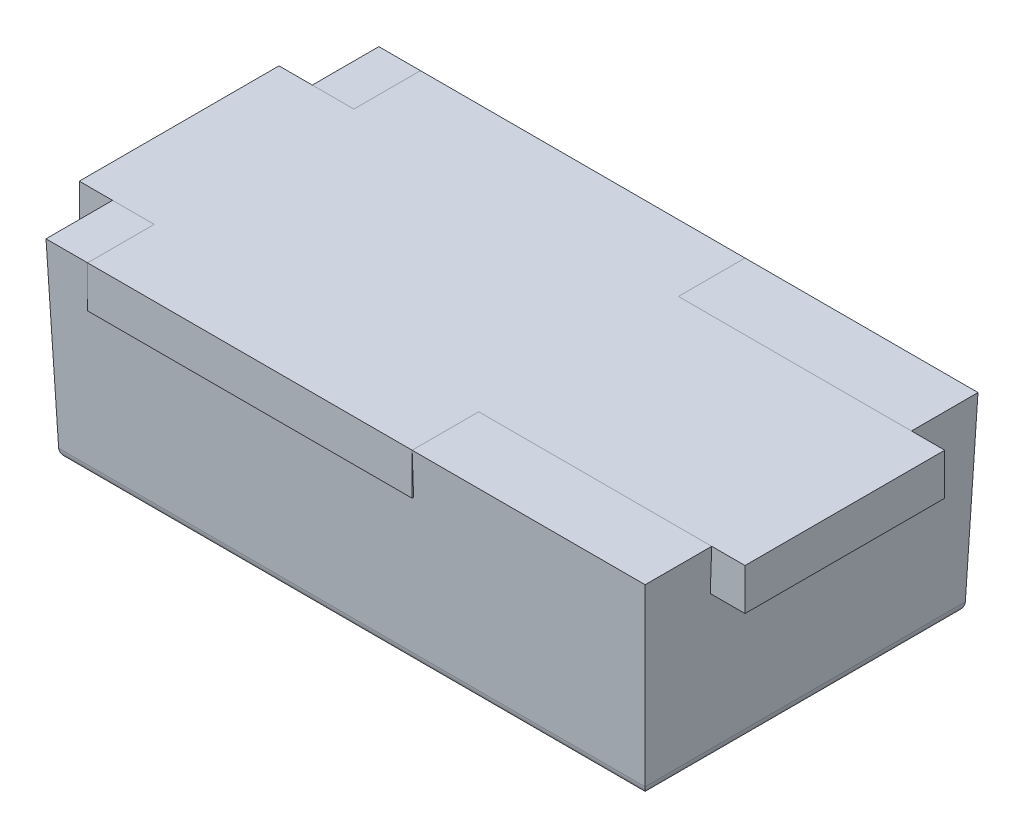
ISO-10303-21;
HEADER;
FILE_DESCRIPTION(('STEP AP214'),'2;1');
FILE_NAME('part.step','',(''),(''),'','','');
FILE_SCHEMA(('AUTOMOTIVE_DESIGN { 1 0 10303 214 1 1 1 1 }'));
ENDSEC;
DATA;
#1=APPLICATION_CONTEXT('core data for automotive mechanical design processes');
#2=APPLICATION_PROTOCOL_DEFINITION('international standard','automotive_design',2000,#1);
#3=PRODUCT_CONTEXT('',#1,'mechanical');
#4=PRODUCT('Part','Part','',(#3));
#5=PRODUCT_RELATED_PRODUCT_CATEGORY('part','',(#4));
#6=PRODUCT_DEFINITION_FORMATION('','',#4);
#7=PRODUCT_DEFINITION_CONTEXT('part definition',#1,'design');
#8=PRODUCT_DEFINITION('design','',#6,#7);
#9=PRODUCT_DEFINITION_SHAPE('','',#8);
#10=(LENGTH_UNIT() NAMED_UNIT(*) SI_UNIT(.MILLI.,.METRE.));
#11=(NAMED_UNIT(*) PLANE_ANGLE_UNIT() SI_UNIT($,.RADIAN.));
#12=(NAMED_UNIT(*) SI_UNIT($,.STERADIAN.) SOLID_ANGLE_UNIT());
#13=UNCERTAINTY_MEASURE_WITH_UNIT(LENGTH_MEASURE(1.E-05),#10,'distance_accuracy_value','');
#14=(GEOMETRIC_REPRESENTATION_CONTEXT(3) GLOBAL_UNCERTAINTY_ASSIGNED_CONTEXT((#13)) GLOBAL_UNIT_ASSIGNED_CONTEXT((#10,
#11,#12)) REPRESENTATION_CONTEXT('',''));
#15=CARTESIAN_POINT('',(0.,0.,0.));
#16=DIRECTION('',(0.,0.,1.));
#17=DIRECTION('',(1.,0.,0.));
#18=AXIS2_PLACEMENT_3D('',#15,#16,#17);
#19=CARTESIAN_POINT('',(-2.,-0.25,0.6));
#20=DIRECTION('',(0.,0.,1.));
#21=DIRECTION('',(1.,0.,0.));
#22=AXIS2_PLACEMENT_3D('',#19,#20,#21);
#23=PLANE('',#22);
#24=DIRECTION('',(0.,1.,0.));
#25=VECTOR('',#24,1.);
#26=CARTESIAN_POINT('',(0.4,-0.25,0.6));
#27=LINE('',#26,#25);
#28=CARTESIAN_POINT('',(0.399999999999999,0.,0.6));
#29=VERTEX_POINT('',#28);
#30=CARTESIAN_POINT('',(0.4,-0.25,0.6));
#31=VERTEX_POINT('',#30);
#32=EDGE_CURVE('P0_E109',#29,#31,#27,.F.);
#33=ORIENTED_EDGE('',*,*,#32,.F.);
#34=DIRECTION('',(1.,0.,0.));
#35=VECTOR('',#34,1.);
#36=CARTESIAN_POINT('',(0.,0.,0.6));
#37=LINE('',#36,#35);
#38=CARTESIAN_POINT('',(1.8,0.,0.6));
#39=VERTEX_POINT('',#38);
#40=EDGE_CURVE('P0_E150',#39,#29,#37,.F.);
#41=ORIENTED_EDGE('',*,*,#40,.F.);
#42=DIRECTION('',(0.0348994967025021,0.999390827019096,0.));
#43=VECTOR('',#42,1.);
#44=CARTESIAN_POINT('',(1.79126980762706,-0.25,0.6));
#45=LINE('',#44,#43);
#46=CARTESIAN_POINT('',(1.79126980762706,-0.25,0.6));
#47=VERTEX_POINT('',#46);
#48=EDGE_CURVE('P0_E101',#47,#39,#45,.T.);
#49=ORIENTED_EDGE('',*,*,#48,.F.);
#50=DIRECTION('',(1.,0.,0.));
#51=VECTOR('',#50,1.);
#52=CARTESIAN_POINT('',(0.,-0.25,0.6));
#53=LINE('',#52,#51);
#54=EDGE_CURVE('P0_E214',#31,#47,#53,.T.);
#55=ORIENTED_EDGE('',*,*,#54,.F.);
#56=EDGE_LOOP('',(#33,#41,#49,#55));
#57=FACE_BOUND('',#56,.T.);
#58=ADVANCED_FACE('P0_F16',(#57),#23,.F.);
#59=CARTESIAN_POINT('',(-2.,-0.25,-0.6));
#60=DIRECTION('',(0.,0.,1.));
#61=DIRECTION('',(1.,0.,0.));
#62=AXIS2_PLACEMENT_3D('',#59,#60,#61);
#63=PLANE('',#62);
#64=DIRECTION('',(0.,1.,0.));
#65=VECTOR('',#64,1.);
#66=CARTESIAN_POINT('',(0.399999999999999,-0.25,-0.6));
#67=LINE('',#66,#65);
#68=CARTESIAN_POINT('',(0.399999999999999,-0.25,-0.6));
#69=VERTEX_POINT('',#68);
#70=CARTESIAN_POINT('',(0.399999999999999,0.,-0.6));
#71=VERTEX_POINT('',#70);
#72=EDGE_CURVE('P0_E198',#69,#71,#67,.T.);
#73=ORIENTED_EDGE('',*,*,#72,.F.);
#74=DIRECTION('',(1.,0.,0.));
#75=VECTOR('',#74,1.);
#76=CARTESIAN_POINT('',(0.,-0.25,-0.6));
#77=LINE('',#76,#75);
#78=CARTESIAN_POINT('',(1.79126980762706,-0.25,-0.6));
#79=VERTEX_POINT('',#78);
#80=EDGE_CURVE('P0_E204',#79,#69,#77,.F.);
#81=ORIENTED_EDGE('',*,*,#80,.F.);
#82=DIRECTION('',(0.0348994967025021,0.999390827019096,0.));
#83=VECTOR('',#82,1.);
#84=CARTESIAN_POINT('',(1.79126980762706,-0.25,-0.6));
#85=LINE('',#84,#83);
#86=CARTESIAN_POINT('',(1.8,0.,-0.6));
#87=VERTEX_POINT('',#86);
#88=EDGE_CURVE('P0_E201',#79,#87,#85,.T.);
#89=ORIENTED_EDGE('',*,*,#88,.T.);
#90=DIRECTION('',(1.,0.,0.));
#91=VECTOR('',#90,1.);
#92=CARTESIAN_POINT('',(0.,0.,-0.6));
#93=LINE('',#92,#91);
#94=EDGE_CURVE('P0_E248',#71,#87,#93,.T.);
#95=ORIENTED_EDGE('',*,*,#94,.F.);
#96=EDGE_LOOP('',(#73,#81,#89,#95));
#97=FACE_BOUND('',#96,.T.);
#98=ADVANCED_FACE('P0_F566',(#97),#63,.T.);
#99=CARTESIAN_POINT('',(-1.55,-0.25,0.));
#100=DIRECTION('',(-1.,0.,0.));
#101=DIRECTION('',(0.,0.,1.));
#102=AXIS2_PLACEMENT_3D('',#99,#100,#101);
#103=PLANE('',#102);
#104=DIRECTION('',(0.,1.,0.));
#105=VECTOR('',#104,1.);
#106=CARTESIAN_POINT('',(-1.55,-0.25,-0.6));
#107=LINE('',#106,#105);
#108=CARTESIAN_POINT('',(-1.55,-0.25,-0.6));
#109=VERTEX_POINT('',#108);
#110=CARTESIAN_POINT('',(-1.55,0.,-0.6));
#111=VERTEX_POINT('',#110);
#112=EDGE_CURVE('P0_E131',#109,#111,#107,.T.);
#113=ORIENTED_EDGE('',*,*,#112,.F.);
#114=DIRECTION('',(0.,0.,1.));
#115=VECTOR('',#114,1.);
#116=CARTESIAN_POINT('',(-1.55,-0.25,0.));
#117=LINE('',#116,#115);
#118=CARTESIAN_POINT('',(-1.55,-0.25,-0.991269807627063));
#119=VERTEX_POINT('',#118);
#120=EDGE_CURVE('P0_E195',#119,#109,#117,.T.);
#121=ORIENTED_EDGE('',*,*,#120,.F.);
#122=DIRECTION('',(0.,0.999390827019096,-0.034899496702501));
#123=VECTOR('',#122,1.);
#124=CARTESIAN_POINT('',(-1.55,0.,-1.));
#125=LINE('',#124,#123);
#126=CARTESIAN_POINT('',(-1.55,0.,-1.));
#127=VERTEX_POINT('',#126);
#128=EDGE_CURVE('P0_E155',#127,#119,#125,.F.);
#129=ORIENTED_EDGE('',*,*,#128,.F.);
#130=DIRECTION('',(0.,0.,1.));
#131=VECTOR('',#130,1.);
#132=CARTESIAN_POINT('',(-1.55,0.,0.));
#133=LINE('',#132,#131);
#134=EDGE_CURVE('P0_E143',#111,#127,#133,.F.);
#135=ORIENTED_EDGE('',*,*,#134,.F.);
#136=EDGE_LOOP('',(#113,#121,#129,#135));
#137=FACE_BOUND('',#136,.T.);
#138=ADVANCED_FACE('P0_F153',(#137),#103,.F.);
#139=CARTESIAN_POINT('',(0.399999999999999,-0.25,0.));
#140=DIRECTION('',(-1.,0.,0.));
#141=DIRECTION('',(0.,0.,1.));
#142=AXIS2_PLACEMENT_3D('',#139,#140,#141);
#143=PLANE('',#142);
#144=ORIENTED_EDGE('',*,*,#72,.T.);
#145=DIRECTION('',(0.,0.,1.));
#146=VECTOR('',#145,1.);
#147=CARTESIAN_POINT('',(0.399999999999999,0.,0.));
#148=LINE('',#147,#146);
#149=CARTESIAN_POINT('',(0.399999999999999,0.,-1.));
#150=VERTEX_POINT('',#149);
#151=EDGE_CURVE('P0_E200',#150,#71,#148,.T.);
#152=ORIENTED_EDGE('',*,*,#151,.F.);
#153=DIRECTION('',(0.,0.999390827019096,-0.034899496702501));
#154=VECTOR('',#153,1.);
#155=CARTESIAN_POINT('',(0.399999999999999,0.,-1.));
#156=LINE('',#155,#154);
#157=CARTESIAN_POINT('',(0.399999999999999,-0.25,-0.991269807627063));
#158=VERTEX_POINT('',#157);
#159=EDGE_CURVE('P0_E299',#158,#150,#156,.T.);
#160=ORIENTED_EDGE('',*,*,#159,.F.);
#161=DIRECTION('',(0.,0.,1.));
#162=VECTOR('',#161,1.);
#163=CARTESIAN_POINT('',(0.399999999999999,-0.25,0.));
#164=LINE('',#163,#162);
#165=EDGE_CURVE('P0_E206',#69,#158,#164,.F.);
#166=ORIENTED_EDGE('',*,*,#165,.F.);
#167=EDGE_LOOP('',(#144,#152,#160,#166));
#168=FACE_BOUND('',#167,.T.);
#169=ADVANCED_FACE('P0_F373',(#168),#143,.T.);
#170=CARTESIAN_POINT('',(0.,0.,0.));
#171=DIRECTION('',(0.,1.,0.));
#172=DIRECTION('',(0.,0.,1.));
#173=AXIS2_PLACEMENT_3D('',#170,#171,#172);
#174=PLANE('',#173);
#175=ORIENTED_EDGE('',*,*,#94,.T.);
#176=DIRECTION('',(0.,0.,1.));
#177=VECTOR('',#176,1.);
#178=CARTESIAN_POINT('',(1.8,0.,0.));
#179=LINE('',#178,#177);
#180=CARTESIAN_POINT('',(1.8,0.,-1.));
#181=VERTEX_POINT('',#180);
#182=EDGE_CURVE('P0_E65',#87,#181,#179,.F.);
#183=ORIENTED_EDGE('',*,*,#182,.T.);
#184=DIRECTION('',(1.,0.,0.));
#185=VECTOR('',#184,1.);
#186=CARTESIAN_POINT('',(-1.8,0.,-1.));
#187=LINE('',#186,#185);
#188=EDGE_CURVE('P0_E295',#150,#181,#187,.T.);
#189=ORIENTED_EDGE('',*,*,#188,.F.);
#190=ORIENTED_EDGE('',*,*,#151,.T.);
#191=EDGE_LOOP('',(#175,#183,#189,#190));
#192=FACE_BOUND('',#191,.T.);
#193=ADVANCED_FACE('P0_F543',(#192),#174,.T.);
#194=CARTESIAN_POINT('',(-2.,-0.25,0.6));
#195=DIRECTION('',(0.,0.,1.));
#196=DIRECTION('',(1.,0.,0.));
#197=AXIS2_PLACEMENT_3D('',#194,#195,#196);
#198=PLANE('',#197);
#199=DIRECTION('',(1.,0.,0.));
#200=VECTOR('',#199,1.);
#201=CARTESIAN_POINT('',(0.,0.,0.6));
#202=LINE('',#201,#200);
#203=CARTESIAN_POINT('',(-1.55,0.,0.6));
#204=VERTEX_POINT('',#203);
#205=CARTESIAN_POINT('',(-1.8,0.,0.6));
#206=VERTEX_POINT('',#205);
#207=EDGE_CURVE('P0_E166',#204,#206,#202,.F.);
#208=ORIENTED_EDGE('',*,*,#207,.F.);
#209=DIRECTION('',(0.,1.,0.));
#210=VECTOR('',#209,1.);
#211=CARTESIAN_POINT('',(-1.55,-0.25,0.6));
#212=LINE('',#211,#210);
#213=CARTESIAN_POINT('',(-1.55,-0.25,0.6));
#214=VERTEX_POINT('',#213);
#215=EDGE_CURVE('P0_E170',#204,#214,#212,.F.);
#216=ORIENTED_EDGE('',*,*,#215,.T.);
#217=DIRECTION('',(1.,0.,0.));
#218=VECTOR('',#217,1.);
#219=CARTESIAN_POINT('',(0.,-0.25,0.6));
#220=LINE('',#219,#218);
#221=CARTESIAN_POINT('',(-1.79126980762706,-0.25,0.6));
#222=VERTEX_POINT('',#221);
#223=EDGE_CURVE('P0_E186',#222,#214,#220,.T.);
#224=ORIENTED_EDGE('',*,*,#223,.F.);
#225=DIRECTION('',(0.034899496702501,-0.999390827019096,0.));
#226=VECTOR('',#225,1.);
#227=CARTESIAN_POINT('',(-1.8,0.,0.6));
#228=LINE('',#227,#226);
#229=EDGE_CURVE('P0_E239',#206,#222,#228,.T.);
#230=ORIENTED_EDGE('',*,*,#229,.F.);
#231=EDGE_LOOP('',(#208,#216,#224,#230));
#232=FACE_BOUND('',#231,.T.);
#233=ADVANCED_FACE('P0_F535',(#232),#198,.F.);
#234=CARTESIAN_POINT('',(-2.,-0.25,-0.6));
#235=DIRECTION('',(0.,0.,1.));
#236=DIRECTION('',(1.,0.,0.));
#237=AXIS2_PLACEMENT_3D('',#234,#235,#236);
#238=PLANE('',#237);
#239=DIRECTION('',(1.,0.,0.));
#240=VECTOR('',#239,1.);
#241=CARTESIAN_POINT('',(0.,0.,-0.6));
#242=LINE('',#241,#240);
#243=CARTESIAN_POINT('',(-1.8,0.,-0.6));
#244=VERTEX_POINT('',#243);
#245=EDGE_CURVE('P0_E136',#244,#111,#242,.T.);
#246=ORIENTED_EDGE('',*,*,#245,.F.);
#247=DIRECTION('',(0.034899496702501,-0.999390827019096,0.));
#248=VECTOR('',#247,1.);
#249=CARTESIAN_POINT('',(-1.8,0.,-0.6));
#250=LINE('',#249,#248);
#251=CARTESIAN_POINT('',(-1.79126980762706,-0.25,-0.6));
#252=VERTEX_POINT('',#251);
#253=EDGE_CURVE('P0_E238',#252,#244,#250,.F.);
#254=ORIENTED_EDGE('',*,*,#253,.F.);
#255=DIRECTION('',(1.,0.,0.));
#256=VECTOR('',#255,1.);
#257=CARTESIAN_POINT('',(0.,-0.25,-0.6));
#258=LINE('',#257,#256);
#259=EDGE_CURVE('P0_E139',#109,#252,#258,.F.);
#260=ORIENTED_EDGE('',*,*,#259,.F.);
#261=ORIENTED_EDGE('',*,*,#112,.T.);
#262=EDGE_LOOP('',(#246,#254,#260,#261));
#263=FACE_BOUND('',#262,.T.);
#264=ADVANCED_FACE('P0_F133',(#263),#238,.T.);
#265=CARTESIAN_POINT('',(0.,0.,0.));
#266=DIRECTION('',(0.,1.,0.));
#267=DIRECTION('',(0.,0.,1.));
#268=AXIS2_PLACEMENT_3D('',#265,#266,#267);
#269=PLANE('',#268);
#270=DIRECTION('',(0.,0.,1.));
#271=VECTOR('',#270,1.);
#272=CARTESIAN_POINT('',(-1.8,0.,-1.));
#273=LINE('',#272,#271);
#274=CARTESIAN_POINT('',(-1.8,0.,-1.));
#275=VERTEX_POINT('',#274);
#276=EDGE_CURVE('P0_E149',#244,#275,#273,.F.);
#277=ORIENTED_EDGE('',*,*,#276,.F.);
#278=ORIENTED_EDGE('',*,*,#245,.T.);
#279=ORIENTED_EDGE('',*,*,#134,.T.);
#280=DIRECTION('',(1.,0.,0.));
#281=VECTOR('',#280,1.);
#282=CARTESIAN_POINT('',(-1.8,0.,-1.));
#283=LINE('',#282,#281);
#284=EDGE_CURVE('P0_E326',#275,#127,#283,.T.);
#285=ORIENTED_EDGE('',*,*,#284,.F.);
#286=EDGE_LOOP('',(#277,#278,#279,#285));
#287=FACE_BOUND('',#286,.T.);
#288=ADVANCED_FACE('P0_F146',(#287),#269,.T.);
#289=CARTESIAN_POINT('',(0.,0.,0.));
#290=DIRECTION('',(0.,1.,0.));
#291=DIRECTION('',(0.,0.,1.));
#292=AXIS2_PLACEMENT_3D('',#289,#290,#291);
#293=PLANE('',#292);
#294=DIRECTION('',(1.,0.,0.));
#295=VECTOR('',#294,1.);
#296=CARTESIAN_POINT('',(-1.8,0.,1.));
#297=LINE('',#296,#295);
#298=CARTESIAN_POINT('',(1.8,0.,1.));
#299=VERTEX_POINT('',#298);
#300=CARTESIAN_POINT('',(0.399999999999999,0.,1.));
#301=VERTEX_POINT('',#300);
#302=EDGE_CURVE('P0_E288',#299,#301,#297,.F.);
#303=ORIENTED_EDGE('',*,*,#302,.F.);
#304=DIRECTION('',(0.,0.,1.));
#305=VECTOR('',#304,1.);
#306=CARTESIAN_POINT('',(1.8,0.,0.));
#307=LINE('',#306,#305);
#308=EDGE_CURVE('P0_E243',#299,#39,#307,.F.);
#309=ORIENTED_EDGE('',*,*,#308,.T.);
#310=ORIENTED_EDGE('',*,*,#40,.T.);
#311=DIRECTION('',(0.,0.,1.));
#312=VECTOR('',#311,1.);
#313=CARTESIAN_POINT('',(0.399999999999999,0.,0.));
#314=LINE('',#313,#312);
#315=EDGE_CURVE('P0_E227',#301,#29,#314,.F.);
#316=ORIENTED_EDGE('',*,*,#315,.F.);
#317=EDGE_LOOP('',(#303,#309,#310,#316));
#318=FACE_BOUND('',#317,.T.);
#319=ADVANCED_FACE('P0_F512',(#318),#293,.T.);
#320=CARTESIAN_POINT('',(0.399999999999999,-0.25,0.));
#321=DIRECTION('',(-1.,0.,0.));
#322=DIRECTION('',(0.,0.,1.));
#323=AXIS2_PLACEMENT_3D('',#320,#321,#322);
#324=PLANE('',#323);
#325=DIRECTION('',(0.,0.,1.));
#326=VECTOR('',#325,1.);
#327=CARTESIAN_POINT('',(0.4,-0.25,0.));
#328=LINE('',#327,#326);
#329=CARTESIAN_POINT('',(0.399999999999999,-0.25,0.991269807627063));
#330=VERTEX_POINT('',#329);
#331=EDGE_CURVE('P0_E189',#330,#31,#328,.F.);
#332=ORIENTED_EDGE('',*,*,#331,.F.);
#333=DIRECTION('',(0.,-0.999390827019096,-0.034899496702501));
#334=VECTOR('',#333,1.);
#335=CARTESIAN_POINT('',(0.399999999999999,0.,1.));
#336=LINE('',#335,#334);
#337=EDGE_CURVE('P0_E232',#301,#330,#336,.T.);
#338=ORIENTED_EDGE('',*,*,#337,.F.);
#339=ORIENTED_EDGE('',*,*,#315,.T.);
#340=ORIENTED_EDGE('',*,*,#32,.T.);
#341=EDGE_LOOP('',(#332,#338,#339,#340));
#342=FACE_BOUND('',#341,.T.);
#343=ADVANCED_FACE('P0_F504',(#342),#324,.T.);
#344=CARTESIAN_POINT('',(0.,-0.25,0.));
#345=DIRECTION('',(0.,1.,0.));
#346=DIRECTION('',(0.,0.,1.));
#347=AXIS2_PLACEMENT_3D('',#344,#345,#346);
#348=PLANE('',#347);
#349=ORIENTED_EDGE('',*,*,#259,.T.);
#350=DIRECTION('',(0.,0.,1.));
#351=VECTOR('',#350,1.);
#352=CARTESIAN_POINT('',(-1.79126980762706,-0.25,-1.));
#353=LINE('',#352,#351);
#354=EDGE_CURVE('P0_E235',#222,#252,#353,.F.);
#355=ORIENTED_EDGE('',*,*,#354,.F.);
#356=ORIENTED_EDGE('',*,*,#223,.T.);
#357=DIRECTION('',(0.,0.,1.));
#358=VECTOR('',#357,1.);
#359=CARTESIAN_POINT('',(-1.55,-0.25,0.));
#360=LINE('',#359,#358);
#361=CARTESIAN_POINT('',(-1.55,-0.25,0.991269807627063));
#362=VERTEX_POINT('',#361);
#363=EDGE_CURVE('P0_E167',#214,#362,#360,.T.);
#364=ORIENTED_EDGE('',*,*,#363,.T.);
#365=DIRECTION('',(1.,0.,0.));
#366=VECTOR('',#365,1.);
#367=CARTESIAN_POINT('',(-1.8,-0.25,0.991269807627063));
#368=LINE('',#367,#366);
#369=EDGE_CURVE('P0_E179',#330,#362,#368,.F.);
#370=ORIENTED_EDGE('',*,*,#369,.F.);
#371=ORIENTED_EDGE('',*,*,#331,.T.);
#372=ORIENTED_EDGE('',*,*,#54,.T.);
#373=DIRECTION('',(0.,0.,1.));
#374=VECTOR('',#373,1.);
#375=CARTESIAN_POINT('',(1.79126980762706,-0.25,0.));
#376=LINE('',#375,#374);
#377=EDGE_CURVE('P0_E207',#47,#79,#376,.F.);
#378=ORIENTED_EDGE('',*,*,#377,.T.);
#379=ORIENTED_EDGE('',*,*,#80,.T.);
#380=ORIENTED_EDGE('',*,*,#165,.T.);
#381=DIRECTION('',(1.,0.,0.));
#382=VECTOR('',#381,1.);
#383=CARTESIAN_POINT('',(-1.8,-0.25,-0.991269807627063));
#384=LINE('',#383,#382);
#385=EDGE_CURVE('P0_E347',#119,#158,#384,.T.);
#386=ORIENTED_EDGE('',*,*,#385,.F.);
#387=ORIENTED_EDGE('',*,*,#120,.T.);
#388=EDGE_LOOP('',(#349,#355,#356,#364,#370,#371,#372,#378,#379,#380,#386,#387));
#389=FACE_BOUND('',#388,.T.);
#390=ADVANCED_FACE('P0_F367',(#389),#348,.T.);
#391=CARTESIAN_POINT('',(-1.55,-0.25,0.));
#392=DIRECTION('',(-1.,0.,0.));
#393=DIRECTION('',(0.,0.,1.));
#394=AXIS2_PLACEMENT_3D('',#391,#392,#393);
#395=PLANE('',#394);
#396=ORIENTED_EDGE('',*,*,#363,.F.);
#397=ORIENTED_EDGE('',*,*,#215,.F.);
#398=DIRECTION('',(0.,0.,1.));
#399=VECTOR('',#398,1.);
#400=CARTESIAN_POINT('',(-1.55,0.,0.));
#401=LINE('',#400,#399);
#402=CARTESIAN_POINT('',(-1.55,0.,1.));
#403=VERTEX_POINT('',#402);
#404=EDGE_CURVE('P0_E163',#403,#204,#401,.F.);
#405=ORIENTED_EDGE('',*,*,#404,.F.);
#406=DIRECTION('',(0.,-0.999390827019096,-0.034899496702501));
#407=VECTOR('',#406,1.);
#408=CARTESIAN_POINT('',(-1.55,0.,1.));
#409=LINE('',#408,#407);
#410=EDGE_CURVE('P0_E175',#362,#403,#409,.F.);
#411=ORIENTED_EDGE('',*,*,#410,.F.);
#412=EDGE_LOOP('',(#396,#397,#405,#411));
#413=FACE_BOUND('',#412,.T.);
#414=ADVANCED_FACE('P0_F487',(#413),#395,.F.);
#415=CARTESIAN_POINT('',(0.,0.,0.));
#416=DIRECTION('',(0.,1.,0.));
#417=DIRECTION('',(0.,0.,1.));
#418=AXIS2_PLACEMENT_3D('',#415,#416,#417);
#419=PLANE('',#418);
#420=DIRECTION('',(0.,0.,1.));
#421=VECTOR('',#420,1.);
#422=CARTESIAN_POINT('',(-1.8,0.,-1.));
#423=LINE('',#422,#421);
#424=CARTESIAN_POINT('',(-1.8,0.,1.));
#425=VERTEX_POINT('',#424);
#426=EDGE_CURVE('P0_E294',#425,#206,#423,.F.);
#427=ORIENTED_EDGE('',*,*,#426,.F.);
#428=DIRECTION('',(1.,0.,0.));
#429=VECTOR('',#428,1.);
#430=CARTESIAN_POINT('',(-1.8,0.,1.));
#431=LINE('',#430,#429);
#432=EDGE_CURVE('P0_E178',#403,#425,#431,.F.);
#433=ORIENTED_EDGE('',*,*,#432,.F.);
#434=ORIENTED_EDGE('',*,*,#404,.T.);
#435=ORIENTED_EDGE('',*,*,#207,.T.);
#436=EDGE_LOOP('',(#427,#433,#434,#435));
#437=FACE_BOUND('',#436,.T.);
#438=ADVANCED_FACE('P0_F407',(#437),#419,.T.);
#439=CARTESIAN_POINT('',(-1.8,0.,-1.));
#440=DIRECTION('',(0.,-0.034899496702501,-0.999390827019096));
#441=DIRECTION('',(0.,0.999390827019096,-0.034899496702501));
#442=AXIS2_PLACEMENT_3D('',#439,#440,#441);
#443=PLANE('',#442);
#444=ORIENTED_EDGE('',*,*,#159,.T.);
#445=ORIENTED_EDGE('',*,*,#188,.T.);
#446=DIRECTION('',(0.0348782627423747,0.998782765958718,-0.0348782627423747));
#447=VECTOR('',#446,1.);
#448=CARTESIAN_POINT('',(1.76194749334774,-1.08968121854391,-0.961947493347741));
#449=LINE('',#448,#447);
#450=CARTESIAN_POINT('',(1.76194749334774,-1.08968121854391,-0.961947493347741));
#451=VERTEX_POINT('',#450);
#452=EDGE_CURVE('P0_E276',#451,#181,#449,.T.);
#453=ORIENTED_EDGE('',*,*,#452,.F.);
#454=DIRECTION('',(-1.,0.,0.));
#455=VECTOR('',#454,1.);
#456=CARTESIAN_POINT('',(0.,-1.08968121854391,-0.961947493347741));
#457=LINE('',#456,#455);
#458=CARTESIAN_POINT('',(-1.76194749334774,-1.08968121854391,-0.961947493347741));
#459=VERTEX_POINT('',#458);
#460=EDGE_CURVE('P0_E271',#459,#451,#457,.F.);
#461=ORIENTED_EDGE('',*,*,#460,.F.);
#462=DIRECTION('',(0.0348782627423747,-0.998782765958718,0.0348782627423747));
#463=VECTOR('',#462,1.);
#464=CARTESIAN_POINT('',(-1.8,0.,-1.));
#465=LINE('',#464,#463);
#466=EDGE_CURVE('P0_E56',#275,#459,#465,.T.);
#467=ORIENTED_EDGE('',*,*,#466,.F.);
#468=ORIENTED_EDGE('',*,*,#284,.T.);
#469=ORIENTED_EDGE('',*,*,#128,.T.);
#470=ORIENTED_EDGE('',*,*,#385,.T.);
#471=EDGE_LOOP('',(#444,#445,#453,#461,#467,#468,#469,#470));
#472=FACE_BOUND('',#471,.T.);
#473=ADVANCED_FACE('P0_F362',(#472),#443,.T.);
#474=CARTESIAN_POINT('',(-1.8,0.,-1.));
#475=DIRECTION('',(-0.999390827019096,-0.034899496702501,0.));
#476=DIRECTION('',(0.034899496702501,-0.999390827019096,0.));
#477=AXIS2_PLACEMENT_3D('',#474,#475,#476);
#478=PLANE('',#477);
#479=ORIENTED_EDGE('',*,*,#253,.T.);
#480=ORIENTED_EDGE('',*,*,#276,.T.);
#481=ORIENTED_EDGE('',*,*,#466,.T.);
#482=DIRECTION('',(0.,0.,-1.));
#483=VECTOR('',#482,1.);
#484=CARTESIAN_POINT('',(-1.76194749334774,-1.08968121854391,-1.));
#485=LINE('',#484,#483);
#486=CARTESIAN_POINT('',(-1.76194749334774,-1.08968121854391,0.961947493347742));
#487=VERTEX_POINT('',#486);
#488=EDGE_CURVE('P0_E259',#487,#459,#485,.T.);
#489=ORIENTED_EDGE('',*,*,#488,.F.);
#490=DIRECTION('',(0.0348782627423745,-0.998782765958718,-0.0348782627423747));
#491=VECTOR('',#490,1.);
#492=CARTESIAN_POINT('',(-1.8,0.,1.));
#493=LINE('',#492,#491);
#494=EDGE_CURVE('P0_E286',#425,#487,#493,.T.);
#495=ORIENTED_EDGE('',*,*,#494,.F.);
#496=ORIENTED_EDGE('',*,*,#426,.T.);
#497=ORIENTED_EDGE('',*,*,#229,.T.);
#498=ORIENTED_EDGE('',*,*,#354,.T.);
#499=EDGE_LOOP('',(#479,#480,#481,#489,#495,#496,#497,#498));
#500=FACE_BOUND('',#499,.T.);
#501=ADVANCED_FACE('P0_F398',(#500),#478,.T.);
#502=CARTESIAN_POINT('',(-1.8,0.,1.));
#503=DIRECTION('',(0.,-0.034899496702501,0.999390827019096));
#504=DIRECTION('',(0.,-0.999390827019096,-0.034899496702501));
#505=AXIS2_PLACEMENT_3D('',#502,#503,#504);
#506=PLANE('',#505);
#507=ORIENTED_EDGE('',*,*,#410,.T.);
#508=ORIENTED_EDGE('',*,*,#432,.T.);
#509=ORIENTED_EDGE('',*,*,#494,.T.);
#510=DIRECTION('',(-1.,0.,0.));
#511=VECTOR('',#510,1.);
#512=CARTESIAN_POINT('',(-1.8,-1.08968121854391,0.961947493347742));
#513=LINE('',#512,#511);
#514=CARTESIAN_POINT('',(1.76194749334774,-1.08968121854391,0.961947493347741));
#515=VERTEX_POINT('',#514);
#516=EDGE_CURVE('P0_E257',#515,#487,#513,.T.);
#517=ORIENTED_EDGE('',*,*,#516,.F.);
#518=DIRECTION('',(-0.0348782627423747,-0.998782765958718,-0.0348782627423751));
#519=VECTOR('',#518,1.);
#520=CARTESIAN_POINT('',(1.8,0.,1.));
#521=LINE('',#520,#519);
#522=EDGE_CURVE('P0_E279',#299,#515,#521,.T.);
#523=ORIENTED_EDGE('',*,*,#522,.F.);
#524=ORIENTED_EDGE('',*,*,#302,.T.);
#525=ORIENTED_EDGE('',*,*,#337,.T.);
#526=ORIENTED_EDGE('',*,*,#369,.T.);
#527=EDGE_LOOP('',(#507,#508,#509,#517,#523,#524,#525,#526));
#528=FACE_BOUND('',#527,.T.);
#529=ADVANCED_FACE('P0_F395',(#528),#506,.T.);
#530=CARTESIAN_POINT('',(1.8,0.,-1.));
#531=DIRECTION('',(0.999390827019096,-0.034899496702501,0.));
#532=DIRECTION('',(0.034899496702501,0.999390827019096,0.));
#533=AXIS2_PLACEMENT_3D('',#530,#531,#532);
#534=PLANE('',#533);
#535=ORIENTED_EDGE('',*,*,#48,.T.);
#536=ORIENTED_EDGE('',*,*,#308,.F.);
#537=ORIENTED_EDGE('',*,*,#522,.T.);
#538=DIRECTION('',(0.,0.,-1.));
#539=VECTOR('',#538,1.);
#540=CARTESIAN_POINT('',(1.76194749334774,-1.08968121854391,0.));
#541=LINE('',#540,#539);
#542=EDGE_CURVE('P0_E254',#451,#515,#541,.F.);
#543=ORIENTED_EDGE('',*,*,#542,.F.);
#544=ORIENTED_EDGE('',*,*,#452,.T.);
#545=ORIENTED_EDGE('',*,*,#182,.F.);
#546=ORIENTED_EDGE('',*,*,#88,.F.);
#547=ORIENTED_EDGE('',*,*,#377,.F.);
#548=EDGE_LOOP('',(#535,#536,#537,#543,#544,#545,#546,#547));
#549=FACE_BOUND('',#548,.T.);
#550=ADVANCED_FACE('P0_F378',(#549),#534,.T.);
#551=CARTESIAN_POINT('',(0.,-1.0875,-0.899485566659048));
#552=DIRECTION('',(-1.,0.,0.));
#553=DIRECTION('',(0.,0.,1.));
#554=AXIS2_PLACEMENT_3D('',#551,#552,#553);
#555=CYLINDRICAL_SURFACE('',#554,0.0625000000000001);
#556=CARTESIAN_POINT('',(-1.69948556665905,-1.0875,-0.899485566659048));
#557=DIRECTION('',(0.707106781186547,0.,-0.707106781186548));
#558=DIRECTION('',(-0.707106781186547,0.,-0.707106781186547));
#559=AXIS2_PLACEMENT_3D('',#556,#557,#558);
#560=ELLIPSE('',#559,0.0883883476483185,0.0625000000000001);
#561=CARTESIAN_POINT('',(-1.69948556665905,-1.15,-0.899485566659048));
#562=VERTEX_POINT('',#561);
#563=EDGE_CURVE('P0_E19',#459,#562,#560,.F.);
#564=ORIENTED_EDGE('',*,*,#563,.F.);
#565=ORIENTED_EDGE('',*,*,#460,.T.);
#566=CARTESIAN_POINT('',(1.69948556665905,-1.0875,-0.899485566659048));
#567=DIRECTION('',(-0.707106781186547,0.,-0.707106781186547));
#568=DIRECTION('',(0.707106781186547,0.,-0.707106781186547));
#569=AXIS2_PLACEMENT_3D('',#566,#567,#568);
#570=ELLIPSE('',#569,0.0883883476483185,0.0625000000000001);
#571=CARTESIAN_POINT('',(1.69948556665905,-1.15,-0.899485566659048));
#572=VERTEX_POINT('',#571);
#573=EDGE_CURVE('P0_E255',#572,#451,#570,.F.);
#574=ORIENTED_EDGE('',*,*,#573,.F.);
#575=DIRECTION('',(1.,0.,0.));
#576=VECTOR('',#575,1.);
#577=CARTESIAN_POINT('',(0.,-1.15,-0.899485566659048));
#578=LINE('',#577,#576);
#579=EDGE_CURVE('P0_E253',#572,#562,#578,.F.);
#580=ORIENTED_EDGE('',*,*,#579,.T.);
#581=EDGE_LOOP('',(#564,#565,#574,#580));
#582=FACE_BOUND('',#581,.T.);
#583=ADVANCED_FACE('P0_F421',(#582),#555,.T.);
#584=CARTESIAN_POINT('',(-1.69948556665905,-1.0875,-1.));
#585=DIRECTION('',(0.,0.,-1.));
#586=DIRECTION('',(-1.,0.,0.));
#587=AXIS2_PLACEMENT_3D('',#584,#585,#586);
#588=CYLINDRICAL_SURFACE('',#587,0.0625000000000001);
#589=CARTESIAN_POINT('',(-1.69948556665905,-1.0875,0.899485566659048));
#590=DIRECTION('',(-0.707106781186547,0.,-0.707106781186547));
#591=DIRECTION('',(-0.707106781186547,0.,0.707106781186548));
#592=AXIS2_PLACEMENT_3D('',#589,#590,#591);
#593=ELLIPSE('',#592,0.0883883476483185,0.0625000000000001);
#594=CARTESIAN_POINT('',(-1.69948556665905,-1.15,0.899485566659048));
#595=VERTEX_POINT('',#594);
#596=EDGE_CURVE('P0_E258',#487,#595,#593,.F.);
#597=ORIENTED_EDGE('',*,*,#596,.F.);
#598=ORIENTED_EDGE('',*,*,#488,.T.);
#599=ORIENTED_EDGE('',*,*,#563,.T.);
#600=DIRECTION('',(0.,0.,1.));
#601=VECTOR('',#600,1.);
#602=CARTESIAN_POINT('',(-1.69948556665905,-1.15,0.));
#603=LINE('',#602,#601);
#604=EDGE_CURVE('P0_E274',#562,#595,#603,.T.);
#605=ORIENTED_EDGE('',*,*,#604,.T.);
#606=EDGE_LOOP('',(#597,#598,#599,#605));
#607=FACE_BOUND('',#606,.T.);
#608=ADVANCED_FACE('P0_F390',(#607),#588,.T.);
#609=CARTESIAN_POINT('',(-1.8,-1.0875,0.899485566659048));
#610=DIRECTION('',(-1.,0.,0.));
#611=DIRECTION('',(0.,0.,1.));
#612=AXIS2_PLACEMENT_3D('',#609,#610,#611);
#613=CYLINDRICAL_SURFACE('',#612,0.0625000000000001);
#614=CARTESIAN_POINT('',(1.69948556665905,-1.0875,0.899485566659048));
#615=DIRECTION('',(0.707106781186547,0.,-0.707106781186547));
#616=DIRECTION('',(-0.707106781186547,0.,-0.707106781186547));
#617=AXIS2_PLACEMENT_3D('',#614,#615,#616);
#618=ELLIPSE('',#617,0.0883883476483185,0.0625000000000001);
#619=CARTESIAN_POINT('',(1.69948556665905,-1.15,0.899485566659048));
#620=VERTEX_POINT('',#619);
#621=EDGE_CURVE('P0_E33',#515,#620,#618,.T.);
#622=ORIENTED_EDGE('',*,*,#621,.F.);
#623=ORIENTED_EDGE('',*,*,#516,.T.);
#624=ORIENTED_EDGE('',*,*,#596,.T.);
#625=DIRECTION('',(1.,0.,0.));
#626=VECTOR('',#625,1.);
#627=CARTESIAN_POINT('',(0.,-1.15,0.899485566659048));
#628=LINE('',#627,#626);
#629=EDGE_CURVE('P0_E25',#595,#620,#628,.T.);
#630=ORIENTED_EDGE('',*,*,#629,.T.);
#631=EDGE_LOOP('',(#622,#623,#624,#630));
#632=FACE_BOUND('',#631,.T.);
#633=ADVANCED_FACE('P0_F393',(#632),#613,.T.);
#634=CARTESIAN_POINT('',(1.69948556665905,-1.0875,0.));
#635=DIRECTION('',(0.,0.,-1.));
#636=DIRECTION('',(-1.,0.,0.));
#637=AXIS2_PLACEMENT_3D('',#634,#635,#636);
#638=CYLINDRICAL_SURFACE('',#637,0.0625000000000001);
#639=ORIENTED_EDGE('',*,*,#621,.T.);
#640=DIRECTION('',(0.,0.,1.));
#641=VECTOR('',#640,1.);
#642=CARTESIAN_POINT('',(1.69948556665905,-1.15,0.));
#643=LINE('',#642,#641);
#644=EDGE_CURVE('P0_E11',#620,#572,#643,.F.);
#645=ORIENTED_EDGE('',*,*,#644,.T.);
#646=ORIENTED_EDGE('',*,*,#573,.T.);
#647=ORIENTED_EDGE('',*,*,#542,.T.);
#648=EDGE_LOOP('',(#639,#645,#646,#647));
#649=FACE_BOUND('',#648,.T.);
#650=ADVANCED_FACE('P0_F410',(#649),#638,.T.);
#651=CARTESIAN_POINT('',(0.,-1.15,0.));
#652=DIRECTION('',(0.,1.,0.));
#653=DIRECTION('',(0.,0.,1.));
#654=AXIS2_PLACEMENT_3D('',#651,#652,#653);
#655=PLANE('',#654);
#656=ORIENTED_EDGE('',*,*,#629,.F.);
#657=ORIENTED_EDGE('',*,*,#604,.F.);
#658=ORIENTED_EDGE('',*,*,#579,.F.);
#659=ORIENTED_EDGE('',*,*,#644,.F.);
#660=EDGE_LOOP('',(#656,#657,#658,#659));
#661=FACE_BOUND('',#660,.T.);
#662=ADVANCED_FACE('P0_F392',(#661),#655,.F.);
#663=CLOSED_SHELL('',(#58,#98,#138,#169,#193,#233,#264,#288,#319,#343,#390,#414,#438,#473,#501,
#529,#550,#583,#608,#633,#650,#662));
#664=MANIFOLD_SOLID_BREP('P0_B1',#663);
#665=CARTESIAN_POINT('',(0.,0.,0.));
#666=DIRECTION('',(0.,1.,0.));
#667=DIRECTION('',(0.,0.,1.));
#668=AXIS2_PLACEMENT_3D('',#665,#666,#667);
#669=PLANE('',#668);
#670=DIRECTION('',(0.,0.,1.));
#671=VECTOR('',#670,1.);
#672=CARTESIAN_POINT('',(2.,0.,0.));
#673=LINE('',#672,#671);
#674=CARTESIAN_POINT('',(2.,0.,0.6));
#675=VERTEX_POINT('',#674);
#676=CARTESIAN_POINT('',(2.,0.,-0.6));
#677=VERTEX_POINT('',#676);
#678=EDGE_CURVE('P1_E109',#675,#677,#673,.F.);
#679=ORIENTED_EDGE('',*,*,#678,.T.);
#680=DIRECTION('',(1.,0.,0.));
#681=VECTOR('',#680,1.);
#682=CARTESIAN_POINT('',(0.,0.,-0.6));
#683=LINE('',#682,#681);
#684=CARTESIAN_POINT('',(0.399999999999999,0.,-0.6));
#685=VERTEX_POINT('',#684);
#686=EDGE_CURVE('P1_E105',#677,#685,#683,.F.);
#687=ORIENTED_EDGE('',*,*,#686,.T.);
#688=DIRECTION('',(0.,0.,1.));
#689=VECTOR('',#688,1.);
#690=CARTESIAN_POINT('',(0.399999999999999,0.,0.));
#691=LINE('',#690,#689);
#692=CARTESIAN_POINT('',(0.399999999999999,0.,-1.));
#693=VERTEX_POINT('',#692);
#694=EDGE_CURVE('P1_E19',#685,#693,#691,.F.);
#695=ORIENTED_EDGE('',*,*,#694,.T.);
#696=DIRECTION('',(1.,0.,0.));
#697=VECTOR('',#696,1.);
#698=CARTESIAN_POINT('',(0.,0.,-1.));
#699=LINE('',#698,#697);
#700=CARTESIAN_POINT('',(-1.55,0.,-1.));
#701=VERTEX_POINT('',#700);
#702=EDGE_CURVE('P1_E112',#693,#701,#699,.F.);
#703=ORIENTED_EDGE('',*,*,#702,.T.);
#704=DIRECTION('',(0.,0.,1.));
#705=VECTOR('',#704,1.);
#706=CARTESIAN_POINT('',(-1.55,0.,0.));
#707=LINE('',#706,#705);
#708=CARTESIAN_POINT('',(-1.55,0.,-0.6));
#709=VERTEX_POINT('',#708);
#710=EDGE_CURVE('P1_E128',#709,#701,#707,.F.);
#711=ORIENTED_EDGE('',*,*,#710,.F.);
#712=DIRECTION('',(1.,0.,0.));
#713=VECTOR('',#712,1.);
#714=CARTESIAN_POINT('',(-2.,0.,-0.6));
#715=LINE('',#714,#713);
#716=CARTESIAN_POINT('',(-2.,0.,-0.6));
#717=VERTEX_POINT('',#716);
#718=EDGE_CURVE('P1_E132',#709,#717,#715,.F.);
#719=ORIENTED_EDGE('',*,*,#718,.T.);
#720=DIRECTION('',(0.,0.,1.));
#721=VECTOR('',#720,1.);
#722=CARTESIAN_POINT('',(-2.,0.,-0.6));
#723=LINE('',#722,#721);
#724=CARTESIAN_POINT('',(-2.,0.,0.6));
#725=VERTEX_POINT('',#724);
#726=EDGE_CURVE('P1_E138',#725,#717,#723,.F.);
#727=ORIENTED_EDGE('',*,*,#726,.F.);
#728=DIRECTION('',(1.,0.,0.));
#729=VECTOR('',#728,1.);
#730=CARTESIAN_POINT('',(-2.,0.,0.6));
#731=LINE('',#730,#729);
#732=CARTESIAN_POINT('',(-1.55,0.,0.6));
#733=VERTEX_POINT('',#732);
#734=EDGE_CURVE('P1_E142',#733,#725,#731,.F.);
#735=ORIENTED_EDGE('',*,*,#734,.F.);
#736=DIRECTION('',(0.,0.,1.));
#737=VECTOR('',#736,1.);
#738=CARTESIAN_POINT('',(-1.55,0.,0.));
#739=LINE('',#738,#737);
#740=CARTESIAN_POINT('',(-1.55,0.,1.));
#741=VERTEX_POINT('',#740);
#742=EDGE_CURVE('P1_E146',#741,#733,#739,.F.);
#743=ORIENTED_EDGE('',*,*,#742,.F.);
#744=DIRECTION('',(1.,0.,0.));
#745=VECTOR('',#744,1.);
#746=CARTESIAN_POINT('',(0.,0.,1.));
#747=LINE('',#746,#745);
#748=CARTESIAN_POINT('',(0.4,0.,1.));
#749=VERTEX_POINT('',#748);
#750=EDGE_CURVE('P1_E150',#749,#741,#747,.F.);
#751=ORIENTED_EDGE('',*,*,#750,.F.);
#752=DIRECTION('',(0.,0.,1.));
#753=VECTOR('',#752,1.);
#754=CARTESIAN_POINT('',(0.4,0.,0.));
#755=LINE('',#754,#753);
#756=CARTESIAN_POINT('',(0.399999999999999,0.,0.6));
#757=VERTEX_POINT('',#756);
#758=EDGE_CURVE('P1_E101',#749,#757,#755,.F.);
#759=ORIENTED_EDGE('',*,*,#758,.T.);
#760=DIRECTION('',(1.,0.,0.));
#761=VECTOR('',#760,1.);
#762=CARTESIAN_POINT('',(0.,0.,0.6));
#763=LINE('',#762,#761);
#764=EDGE_CURVE('P1_E123',#757,#675,#763,.T.);
#765=ORIENTED_EDGE('',*,*,#764,.T.);
#766=EDGE_LOOP('',(#679,#687,#695,#703,#711,#719,#727,#735,#743,#751,#759,#765));
#767=FACE_BOUND('',#766,.T.);
#768=ADVANCED_FACE('P1_F16',(#767),#669,.T.);
#769=CARTESIAN_POINT('',(0.,-0.25,-1.));
#770=DIRECTION('',(0.,0.,1.));
#771=DIRECTION('',(1.,0.,0.));
#772=AXIS2_PLACEMENT_3D('',#769,#770,#771);
#773=PLANE('',#772);
#774=DIRECTION('',(0.,1.,0.));
#775=VECTOR('',#774,1.);
#776=CARTESIAN_POINT('',(0.399999999999999,-0.25,-1.));
#777=LINE('',#776,#775);
#778=CARTESIAN_POINT('',(0.399999999999999,-0.25,-1.));
#779=VERTEX_POINT('',#778);
#780=EDGE_CURVE('P1_E118',#693,#779,#777,.F.);
#781=ORIENTED_EDGE('',*,*,#780,.T.);
#782=DIRECTION('',(1.,0.,0.));
#783=VECTOR('',#782,1.);
#784=CARTESIAN_POINT('',(0.,-0.25,-1.));
#785=LINE('',#784,#783);
#786=CARTESIAN_POINT('',(-1.55,-0.25,-1.));
#787=VERTEX_POINT('',#786);
#788=EDGE_CURVE('P1_E117',#779,#787,#785,.F.);
#789=ORIENTED_EDGE('',*,*,#788,.T.);
#790=DIRECTION('',(0.,1.,0.));
#791=VECTOR('',#790,1.);
#792=CARTESIAN_POINT('',(-1.55,-0.25,-1.));
#793=LINE('',#792,#791);
#794=EDGE_CURVE('P1_E130',#701,#787,#793,.F.);
#795=ORIENTED_EDGE('',*,*,#794,.F.);
#796=ORIENTED_EDGE('',*,*,#702,.F.);
#797=EDGE_LOOP('',(#781,#789,#795,#796));
#798=FACE_BOUND('',#797,.T.);
#799=ADVANCED_FACE('P1_F234',(#798),#773,.F.);
#800=CARTESIAN_POINT('',(-1.55,-0.25,0.));
#801=DIRECTION('',(-1.,0.,0.));
#802=DIRECTION('',(0.,0.,1.));
#803=AXIS2_PLACEMENT_3D('',#800,#801,#802);
#804=PLANE('',#803);
#805=DIRECTION('',(0.,0.,1.));
#806=VECTOR('',#805,1.);
#807=CARTESIAN_POINT('',(-1.55,-0.25,0.));
#808=LINE('',#807,#806);
#809=CARTESIAN_POINT('',(-1.55,-0.25,-0.6));
#810=VERTEX_POINT('',#809);
#811=EDGE_CURVE('P1_E167',#787,#810,#808,.T.);
#812=ORIENTED_EDGE('',*,*,#811,.T.);
#813=DIRECTION('',(0.,1.,0.));
#814=VECTOR('',#813,1.);
#815=CARTESIAN_POINT('',(-1.55,-0.25,-0.6));
#816=LINE('',#815,#814);
#817=EDGE_CURVE('P1_E135',#810,#709,#816,.T.);
#818=ORIENTED_EDGE('',*,*,#817,.T.);
#819=ORIENTED_EDGE('',*,*,#710,.T.);
#820=ORIENTED_EDGE('',*,*,#794,.T.);
#821=EDGE_LOOP('',(#812,#818,#819,#820));
#822=FACE_BOUND('',#821,.T.);
#823=ADVANCED_FACE('P1_F231',(#822),#804,.T.);
#824=CARTESIAN_POINT('',(-2.,-0.25,-0.6));
#825=DIRECTION('',(0.,0.,1.));
#826=DIRECTION('',(1.,0.,0.));
#827=AXIS2_PLACEMENT_3D('',#824,#825,#826);
#828=PLANE('',#827);
#829=DIRECTION('',(1.,0.,0.));
#830=VECTOR('',#829,1.);
#831=CARTESIAN_POINT('',(0.,-0.25,-0.6));
#832=LINE('',#831,#830);
#833=CARTESIAN_POINT('',(-2.,-0.25,-0.6));
#834=VERTEX_POINT('',#833);
#835=EDGE_CURVE('P1_E170',#810,#834,#832,.F.);
#836=ORIENTED_EDGE('',*,*,#835,.T.);
#837=DIRECTION('',(0.,1.,0.));
#838=VECTOR('',#837,1.);
#839=CARTESIAN_POINT('',(-2.,-0.25,-0.6));
#840=LINE('',#839,#838);
#841=EDGE_CURVE('P1_E140',#717,#834,#840,.F.);
#842=ORIENTED_EDGE('',*,*,#841,.F.);
#843=ORIENTED_EDGE('',*,*,#718,.F.);
#844=ORIENTED_EDGE('',*,*,#817,.F.);
#845=EDGE_LOOP('',(#836,#842,#843,#844));
#846=FACE_BOUND('',#845,.T.);
#847=ADVANCED_FACE('P1_F228',(#846),#828,.F.);
#848=CARTESIAN_POINT('',(-2.,-0.25,-0.6));
#849=DIRECTION('',(-1.,0.,0.));
#850=DIRECTION('',(0.,0.,1.));
#851=AXIS2_PLACEMENT_3D('',#848,#849,#850);
#852=PLANE('',#851);
#853=DIRECTION('',(0.,0.,1.));
#854=VECTOR('',#853,1.);
#855=CARTESIAN_POINT('',(-2.,-0.25,0.));
#856=LINE('',#855,#854);
#857=CARTESIAN_POINT('',(-2.,-0.25,0.6));
#858=VERTEX_POINT('',#857);
#859=EDGE_CURVE('P1_E173',#834,#858,#856,.T.);
#860=ORIENTED_EDGE('',*,*,#859,.T.);
#861=DIRECTION('',(0.,1.,0.));
#862=VECTOR('',#861,1.);
#863=CARTESIAN_POINT('',(-2.,-0.25,0.6));
#864=LINE('',#863,#862);
#865=EDGE_CURVE('P1_E144',#725,#858,#864,.F.);
#866=ORIENTED_EDGE('',*,*,#865,.F.);
#867=ORIENTED_EDGE('',*,*,#726,.T.);
#868=ORIENTED_EDGE('',*,*,#841,.T.);
#869=EDGE_LOOP('',(#860,#866,#867,#868));
#870=FACE_BOUND('',#869,.T.);
#871=ADVANCED_FACE('P1_F223',(#870),#852,.T.);
#872=CARTESIAN_POINT('',(-2.,-0.25,0.6));
#873=DIRECTION('',(0.,0.,1.));
#874=DIRECTION('',(1.,0.,0.));
#875=AXIS2_PLACEMENT_3D('',#872,#873,#874);
#876=PLANE('',#875);
#877=ORIENTED_EDGE('',*,*,#734,.T.);
#878=ORIENTED_EDGE('',*,*,#865,.T.);
#879=DIRECTION('',(1.,0.,0.));
#880=VECTOR('',#879,1.);
#881=CARTESIAN_POINT('',(0.,-0.25,0.6));
#882=LINE('',#881,#880);
#883=CARTESIAN_POINT('',(-1.55,-0.25,0.6));
#884=VERTEX_POINT('',#883);
#885=EDGE_CURVE('P1_E176',#858,#884,#882,.T.);
#886=ORIENTED_EDGE('',*,*,#885,.T.);
#887=DIRECTION('',(0.,1.,0.));
#888=VECTOR('',#887,1.);
#889=CARTESIAN_POINT('',(-1.55,-0.25,0.6));
#890=LINE('',#889,#888);
#891=EDGE_CURVE('P1_E148',#733,#884,#890,.F.);
#892=ORIENTED_EDGE('',*,*,#891,.F.);
#893=EDGE_LOOP('',(#877,#878,#886,#892));
#894=FACE_BOUND('',#893,.T.);
#895=ADVANCED_FACE('P1_F219',(#894),#876,.T.);
#896=CARTESIAN_POINT('',(-1.55,-0.25,0.));
#897=DIRECTION('',(-1.,0.,0.));
#898=DIRECTION('',(0.,0.,1.));
#899=AXIS2_PLACEMENT_3D('',#896,#897,#898);
#900=PLANE('',#899);
#901=DIRECTION('',(0.,0.,1.));
#902=VECTOR('',#901,1.);
#903=CARTESIAN_POINT('',(-1.55,-0.25,0.));
#904=LINE('',#903,#902);
#905=CARTESIAN_POINT('',(-1.55,-0.25,1.));
#906=VERTEX_POINT('',#905);
#907=EDGE_CURVE('P1_E179',#884,#906,#904,.T.);
#908=ORIENTED_EDGE('',*,*,#907,.T.);
#909=DIRECTION('',(0.,1.,0.));
#910=VECTOR('',#909,1.);
#911=CARTESIAN_POINT('',(-1.55,-0.25,1.));
#912=LINE('',#911,#910);
#913=EDGE_CURVE('P1_E152',#741,#906,#912,.F.);
#914=ORIENTED_EDGE('',*,*,#913,.F.);
#915=ORIENTED_EDGE('',*,*,#742,.T.);
#916=ORIENTED_EDGE('',*,*,#891,.T.);
#917=EDGE_LOOP('',(#908,#914,#915,#916));
#918=FACE_BOUND('',#917,.T.);
#919=ADVANCED_FACE('P1_F213',(#918),#900,.T.);
#920=CARTESIAN_POINT('',(0.,-0.25,1.));
#921=DIRECTION('',(0.,0.,1.));
#922=DIRECTION('',(1.,0.,0.));
#923=AXIS2_PLACEMENT_3D('',#920,#921,#922);
#924=PLANE('',#923);
#925=DIRECTION('',(1.,0.,0.));
#926=VECTOR('',#925,1.);
#927=CARTESIAN_POINT('',(0.,-0.25,1.));
#928=LINE('',#927,#926);
#929=CARTESIAN_POINT('',(0.4,-0.25,1.));
#930=VERTEX_POINT('',#929);
#931=EDGE_CURVE('P1_E182',#906,#930,#928,.T.);
#932=ORIENTED_EDGE('',*,*,#931,.T.);
#933=DIRECTION('',(0.,1.,0.));
#934=VECTOR('',#933,1.);
#935=CARTESIAN_POINT('',(0.4,-0.25,1.));
#936=LINE('',#935,#934);
#937=EDGE_CURVE('P1_E154',#930,#749,#936,.T.);
#938=ORIENTED_EDGE('',*,*,#937,.T.);
#939=ORIENTED_EDGE('',*,*,#750,.T.);
#940=ORIENTED_EDGE('',*,*,#913,.T.);
#941=EDGE_LOOP('',(#932,#938,#939,#940));
#942=FACE_BOUND('',#941,.T.);
#943=ADVANCED_FACE('P1_F209',(#942),#924,.T.);
#944=CARTESIAN_POINT('',(0.399999999999999,-0.25,0.));
#945=DIRECTION('',(-1.,0.,0.));
#946=DIRECTION('',(0.,0.,1.));
#947=AXIS2_PLACEMENT_3D('',#944,#945,#946);
#948=PLANE('',#947);
#949=ORIENTED_EDGE('',*,*,#937,.F.);
#950=DIRECTION('',(0.,0.,1.));
#951=VECTOR('',#950,1.);
#952=CARTESIAN_POINT('',(0.4,-0.25,0.));
#953=LINE('',#952,#951);
#954=CARTESIAN_POINT('',(0.399999999999999,-0.25,0.6));
#955=VERTEX_POINT('',#954);
#956=EDGE_CURVE('P1_E185',#930,#955,#953,.F.);
#957=ORIENTED_EDGE('',*,*,#956,.T.);
#958=DIRECTION('',(0.,1.,0.));
#959=VECTOR('',#958,1.);
#960=CARTESIAN_POINT('',(0.399999999999999,-0.25,0.6));
#961=LINE('',#960,#959);
#962=EDGE_CURVE('P1_E157',#757,#955,#961,.F.);
#963=ORIENTED_EDGE('',*,*,#962,.F.);
#964=ORIENTED_EDGE('',*,*,#758,.F.);
#965=EDGE_LOOP('',(#949,#957,#963,#964));
#966=FACE_BOUND('',#965,.T.);
#967=ADVANCED_FACE('P1_F205',(#966),#948,.F.);
#968=CARTESIAN_POINT('',(-2.,-0.25,0.6));
#969=DIRECTION('',(0.,0.,1.));
#970=DIRECTION('',(1.,0.,0.));
#971=AXIS2_PLACEMENT_3D('',#968,#969,#970);
#972=PLANE('',#971);
#973=DIRECTION('',(0.,1.,0.));
#974=VECTOR('',#973,1.);
#975=CARTESIAN_POINT('',(2.,-0.25,0.6));
#976=LINE('',#975,#974);
#977=CARTESIAN_POINT('',(2.,-0.25,0.6));
#978=VERTEX_POINT('',#977);
#979=EDGE_CURVE('P1_E159',#978,#675,#976,.T.);
#980=ORIENTED_EDGE('',*,*,#979,.T.);
#981=ORIENTED_EDGE('',*,*,#764,.F.);
#982=ORIENTED_EDGE('',*,*,#962,.T.);
#983=DIRECTION('',(1.,0.,0.));
#984=VECTOR('',#983,1.);
#985=CARTESIAN_POINT('',(0.,-0.25,0.6));
#986=LINE('',#985,#984);
#987=EDGE_CURVE('P1_E188',#955,#978,#986,.T.);
#988=ORIENTED_EDGE('',*,*,#987,.T.);
#989=EDGE_LOOP('',(#980,#981,#982,#988));
#990=FACE_BOUND('',#989,.T.);
#991=ADVANCED_FACE('P1_F202',(#990),#972,.T.);
#992=CARTESIAN_POINT('',(2.,-0.25,-0.6));
#993=DIRECTION('',(-1.,0.,0.));
#994=DIRECTION('',(0.,0.,1.));
#995=AXIS2_PLACEMENT_3D('',#992,#993,#994);
#996=PLANE('',#995);
#997=ORIENTED_EDGE('',*,*,#979,.F.);
#998=DIRECTION('',(0.,0.,1.));
#999=VECTOR('',#998,1.);
#1000=CARTESIAN_POINT('',(2.,-0.25,0.));
#1001=LINE('',#1000,#999);
#1002=CARTESIAN_POINT('',(2.,-0.25,-0.6));
#1003=VERTEX_POINT('',#1002);
#1004=EDGE_CURVE('P1_E191',#978,#1003,#1001,.F.);
#1005=ORIENTED_EDGE('',*,*,#1004,.T.);
#1006=DIRECTION('',(0.,1.,0.));
#1007=VECTOR('',#1006,1.);
#1008=CARTESIAN_POINT('',(2.,-0.25,-0.6));
#1009=LINE('',#1008,#1007);
#1010=EDGE_CURVE('P1_E162',#1003,#677,#1009,.T.);
#1011=ORIENTED_EDGE('',*,*,#1010,.T.);
#1012=ORIENTED_EDGE('',*,*,#678,.F.);
#1013=EDGE_LOOP('',(#997,#1005,#1011,#1012));
#1014=FACE_BOUND('',#1013,.T.);
#1015=ADVANCED_FACE('P1_F196',(#1014),#996,.F.);
#1016=CARTESIAN_POINT('',(-2.,-0.25,-0.6));
#1017=DIRECTION('',(0.,0.,1.));
#1018=DIRECTION('',(1.,0.,0.));
#1019=AXIS2_PLACEMENT_3D('',#1016,#1017,#1018);
#1020=PLANE('',#1019);
#1021=DIRECTION('',(0.,1.,0.));
#1022=VECTOR('',#1021,1.);
#1023=CARTESIAN_POINT('',(0.399999999999999,-0.25,-0.6));
#1024=LINE('',#1023,#1022);
#1025=CARTESIAN_POINT('',(0.399999999999999,-0.25,-0.6));
#1026=VERTEX_POINT('',#1025);
#1027=EDGE_CURVE('P1_E33',#1026,#685,#1024,.T.);
#1028=ORIENTED_EDGE('',*,*,#1027,.T.);
#1029=ORIENTED_EDGE('',*,*,#686,.F.);
#1030=ORIENTED_EDGE('',*,*,#1010,.F.);
#1031=DIRECTION('',(1.,0.,0.));
#1032=VECTOR('',#1031,1.);
#1033=CARTESIAN_POINT('',(0.,-0.25,-0.6));
#1034=LINE('',#1033,#1032);
#1035=EDGE_CURVE('P1_E25',#1003,#1026,#1034,.F.);
#1036=ORIENTED_EDGE('',*,*,#1035,.T.);
#1037=EDGE_LOOP('',(#1028,#1029,#1030,#1036));
#1038=FACE_BOUND('',#1037,.T.);
#1039=ADVANCED_FACE('P1_F115',(#1038),#1020,.F.);
#1040=CARTESIAN_POINT('',(0.399999999999999,-0.25,0.));
#1041=DIRECTION('',(-1.,0.,0.));
#1042=DIRECTION('',(0.,0.,1.));
#1043=AXIS2_PLACEMENT_3D('',#1040,#1041,#1042);
#1044=PLANE('',#1043);
#1045=ORIENTED_EDGE('',*,*,#1027,.F.);
#1046=DIRECTION('',(0.,0.,1.));
#1047=VECTOR('',#1046,1.);
#1048=CARTESIAN_POINT('',(0.399999999999999,-0.25,0.));
#1049=LINE('',#1048,#1047);
#1050=EDGE_CURVE('P1_E11',#1026,#779,#1049,.F.);
#1051=ORIENTED_EDGE('',*,*,#1050,.T.);
#1052=ORIENTED_EDGE('',*,*,#780,.F.);
#1053=ORIENTED_EDGE('',*,*,#694,.F.);
#1054=EDGE_LOOP('',(#1045,#1051,#1052,#1053));
#1055=FACE_BOUND('',#1054,.T.);
#1056=ADVANCED_FACE('P1_F121',(#1055),#1044,.F.);
#1057=CARTESIAN_POINT('',(0.,-0.25,0.));
#1058=DIRECTION('',(0.,1.,0.));
#1059=DIRECTION('',(0.,0.,1.));
#1060=AXIS2_PLACEMENT_3D('',#1057,#1058,#1059);
#1061=PLANE('',#1060);
#1062=ORIENTED_EDGE('',*,*,#1035,.F.);
#1063=ORIENTED_EDGE('',*,*,#1004,.F.);
#1064=ORIENTED_EDGE('',*,*,#987,.F.);
#1065=ORIENTED_EDGE('',*,*,#956,.F.);
#1066=ORIENTED_EDGE('',*,*,#931,.F.);
#1067=ORIENTED_EDGE('',*,*,#907,.F.);
#1068=ORIENTED_EDGE('',*,*,#885,.F.);
#1069=ORIENTED_EDGE('',*,*,#859,.F.);
#1070=ORIENTED_EDGE('',*,*,#835,.F.);
#1071=ORIENTED_EDGE('',*,*,#811,.F.);
#1072=ORIENTED_EDGE('',*,*,#788,.F.);
#1073=ORIENTED_EDGE('',*,*,#1050,.F.);
#1074=EDGE_LOOP('',(#1062,#1063,#1064,#1065,#1066,#1067,#1068,#1069,#1070,#1071,#1072,#1073));
#1075=FACE_BOUND('',#1074,.T.);
#1076=ADVANCED_FACE('P1_F199',(#1075),#1061,.F.);
#1077=CLOSED_SHELL('',(#768,#799,#823,#847,#871,#895,#919,#943,#967,#991,#1015,#1039,#1056,#1076));
#1078=MANIFOLD_SOLID_BREP('P1_B1',#1077);
#1079=ADVANCED_BREP_SHAPE_REPRESENTATION('',(#18,#664,#1078),#14);
#1080=SHAPE_DEFINITION_REPRESENTATION(#9,#1079);
ENDSEC;
END-ISO-10303-21;
